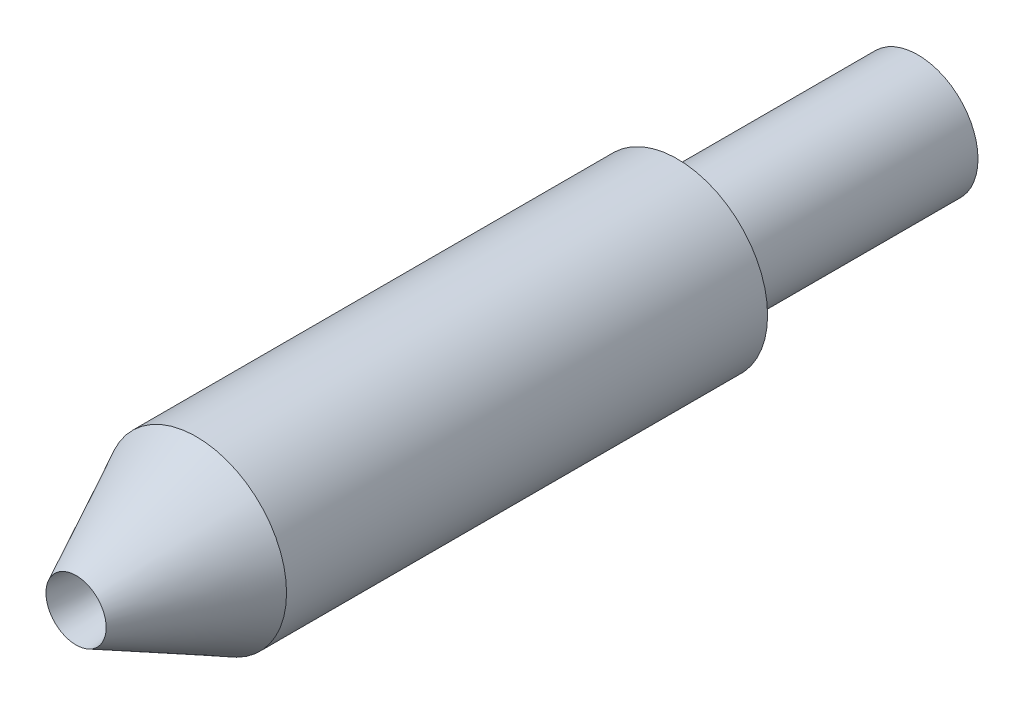
ISO-10303-21;
HEADER;
FILE_DESCRIPTION(('STEP AP214'),'2;1');
FILE_NAME('part.step','',(''),(''),'','','');
FILE_SCHEMA(('AUTOMOTIVE_DESIGN { 1 0 10303 214 1 1 1 1 }'));
ENDSEC;
DATA;
#1=APPLICATION_CONTEXT('core data for automotive mechanical design processes');
#2=APPLICATION_PROTOCOL_DEFINITION('international standard','automotive_design',2000,#1);
#3=PRODUCT_CONTEXT('',#1,'mechanical');
#4=PRODUCT('Part','Part','',(#3));
#5=PRODUCT_RELATED_PRODUCT_CATEGORY('part','',(#4));
#6=PRODUCT_DEFINITION_FORMATION('','',#4);
#7=PRODUCT_DEFINITION_CONTEXT('part definition',#1,'design');
#8=PRODUCT_DEFINITION('design','',#6,#7);
#9=PRODUCT_DEFINITION_SHAPE('','',#8);
#10=(LENGTH_UNIT() NAMED_UNIT(*) SI_UNIT(.MILLI.,.METRE.));
#11=(NAMED_UNIT(*) PLANE_ANGLE_UNIT() SI_UNIT($,.RADIAN.));
#12=(NAMED_UNIT(*) SI_UNIT($,.STERADIAN.) SOLID_ANGLE_UNIT());
#13=UNCERTAINTY_MEASURE_WITH_UNIT(LENGTH_MEASURE(1.E-05),#10,'distance_accuracy_value','');
#14=(GEOMETRIC_REPRESENTATION_CONTEXT(3) GLOBAL_UNCERTAINTY_ASSIGNED_CONTEXT((#13)) GLOBAL_UNIT_ASSIGNED_CONTEXT((#10,
#11,#12)) REPRESENTATION_CONTEXT('',''));
#15=CARTESIAN_POINT('',(0.,0.,0.));
#16=DIRECTION('',(0.,0.,1.));
#17=DIRECTION('',(1.,0.,0.));
#18=AXIS2_PLACEMENT_3D('',#15,#16,#17);
#19=CARTESIAN_POINT('',(0.,0.,-11.1125));
#20=DIRECTION('',(0.,0.,1.));
#21=DIRECTION('',(1.,0.,0.));
#22=AXIS2_PLACEMENT_3D('',#19,#20,#21);
#23=CYLINDRICAL_SURFACE('',#22,1.19126);
#24=CARTESIAN_POINT('',(0.,0.,-1.58749999999999));
#25=DIRECTION('',(0.,0.,1.));
#26=DIRECTION('',(1.,0.,0.));
#27=AXIS2_PLACEMENT_3D('',#24,#25,#26);
#28=CIRCLE('',#27,1.19126);
#29=CARTESIAN_POINT('',(1.19126,0.,-1.58749999999999));
#30=VERTEX_POINT('',#29);
#31=EDGE_CURVE('E12',#30,#30,#28,.T.);
#32=ORIENTED_EDGE('',*,*,#31,.F.);
#33=EDGE_LOOP('',(#32));
#34=FACE_BOUND('',#33,.T.);
#35=CARTESIAN_POINT('',(0.,0.,-7.93749999999999));
#36=DIRECTION('',(0.,0.,1.));
#37=DIRECTION('',(1.,0.,0.));
#38=AXIS2_PLACEMENT_3D('',#35,#36,#37);
#39=CIRCLE('',#38,1.19126);
#40=CARTESIAN_POINT('',(1.19126,0.,-7.93749999999999));
#41=VERTEX_POINT('',#40);
#42=EDGE_CURVE('E64',#41,#41,#39,.T.);
#43=ORIENTED_EDGE('',*,*,#42,.T.);
#44=EDGE_LOOP('',(#43));
#45=FACE_BOUND('',#44,.T.);
#46=ADVANCED_FACE('F48',(#34,#45),#23,.T.);
#47=CARTESIAN_POINT('',(0.,0.,0.));
#48=DIRECTION('',(0.,0.,-1.));
#49=DIRECTION('',(-1.,0.,0.));
#50=AXIS2_PLACEMENT_3D('',#47,#48,#49);
#51=CONICAL_SURFACE('',#50,0.39751,0.463647609000806);
#52=ORIENTED_EDGE('',*,*,#31,.T.);
#53=EDGE_LOOP('',(#52));
#54=FACE_BOUND('',#53,.T.);
#55=CARTESIAN_POINT('',(0.,0.,0.));
#56=DIRECTION('',(0.,0.,1.));
#57=DIRECTION('',(1.,0.,0.));
#58=AXIS2_PLACEMENT_3D('',#55,#56,#57);
#59=CIRCLE('',#58,0.39751);
#60=CARTESIAN_POINT('',(0.39751,0.,0.));
#61=VERTEX_POINT('',#60);
#62=EDGE_CURVE('E67',#61,#61,#59,.T.);
#63=ORIENTED_EDGE('',*,*,#62,.F.);
#64=EDGE_LOOP('',(#63));
#65=FACE_BOUND('',#64,.T.);
#66=ADVANCED_FACE('F96',(#54,#65),#51,.T.);
#67=CARTESIAN_POINT('',(0.,0.,0.));
#68=DIRECTION('',(0.,0.,1.));
#69=DIRECTION('',(1.,0.,0.));
#70=AXIS2_PLACEMENT_3D('',#67,#68,#69);
#71=CYLINDRICAL_SURFACE('',#70,0.793749999999999);
#72=CARTESIAN_POINT('',(0.,0.,-11.1125));
#73=DIRECTION('',(0.,0.,1.));
#74=DIRECTION('',(1.,0.,0.));
#75=AXIS2_PLACEMENT_3D('',#72,#73,#74);
#76=CIRCLE('',#75,0.79375);
#77=CARTESIAN_POINT('',(0.79375,0.,-11.1125));
#78=VERTEX_POINT('',#77);
#79=EDGE_CURVE('E55',#78,#78,#76,.T.);
#80=ORIENTED_EDGE('',*,*,#79,.T.);
#81=EDGE_LOOP('',(#80));
#82=FACE_BOUND('',#81,.T.);
#83=CARTESIAN_POINT('',(0.,0.,-7.93749999999999));
#84=DIRECTION('',(0.,0.,1.));
#85=DIRECTION('',(1.,0.,0.));
#86=AXIS2_PLACEMENT_3D('',#83,#84,#85);
#87=CIRCLE('',#86,0.793749999999999);
#88=CARTESIAN_POINT('',(0.793749999999999,0.,-7.93749999999999));
#89=VERTEX_POINT('',#88);
#90=EDGE_CURVE('E59',#89,#89,#87,.T.);
#91=ORIENTED_EDGE('',*,*,#90,.F.);
#92=EDGE_LOOP('',(#91));
#93=FACE_BOUND('',#92,.T.);
#94=ADVANCED_FACE('F101',(#82,#93),#71,.T.);
#95=CARTESIAN_POINT('',(0.,1.19126,-7.93749999999999));
#96=DIRECTION('',(0.,0.,-1.));
#97=DIRECTION('',(-1.,0.,0.));
#98=AXIS2_PLACEMENT_3D('',#95,#96,#97);
#99=PLANE('',#98);
#100=ORIENTED_EDGE('',*,*,#90,.T.);
#101=EDGE_LOOP('',(#100));
#102=FACE_BOUND('',#101,.T.);
#103=ORIENTED_EDGE('',*,*,#42,.F.);
#104=EDGE_LOOP('',(#103));
#105=FACE_BOUND('',#104,.T.);
#106=ADVANCED_FACE('F92',(#102,#105),#99,.T.);
#107=CARTESIAN_POINT('',(0.,0.,-11.1125));
#108=DIRECTION('',(0.,0.,1.));
#109=DIRECTION('',(1.,0.,0.));
#110=AXIS2_PLACEMENT_3D('',#107,#108,#109);
#111=PLANE('',#110);
#112=CARTESIAN_POINT('',(0.,0.,-11.1125));
#113=DIRECTION('',(0.,0.,1.));
#114=DIRECTION('',(1.,0.,0.));
#115=AXIS2_PLACEMENT_3D('',#112,#113,#114);
#116=CIRCLE('',#115,0.39751);
#117=CARTESIAN_POINT('',(0.39751,0.,-11.1125));
#118=VERTEX_POINT('',#117);
#119=EDGE_CURVE('E51',#118,#118,#116,.T.);
#120=ORIENTED_EDGE('',*,*,#119,.T.);
#121=EDGE_LOOP('',(#120));
#122=FACE_BOUND('',#121,.T.);
#123=ORIENTED_EDGE('',*,*,#79,.F.);
#124=EDGE_LOOP('',(#123));
#125=FACE_BOUND('',#124,.T.);
#126=ADVANCED_FACE('F83',(#122,#125),#111,.F.);
#127=CARTESIAN_POINT('',(0.,0.,-1.58749999999999));
#128=DIRECTION('',(0.,0.,1.));
#129=DIRECTION('',(1.,0.,0.));
#130=AXIS2_PLACEMENT_3D('',#127,#128,#129);
#131=CONICAL_SURFACE('',#130,0.19812,0.124945720086004);
#132=ORIENTED_EDGE('',*,*,#62,.T.);
#133=EDGE_LOOP('',(#132));
#134=FACE_BOUND('',#133,.T.);
#135=CARTESIAN_POINT('',(0.,0.,-1.58749999999999));
#136=DIRECTION('',(0.,0.,1.));
#137=DIRECTION('',(0.,-1.,0.));
#138=AXIS2_PLACEMENT_3D('',#135,#136,#137);
#139=CIRCLE('',#138,0.19812);
#140=CARTESIAN_POINT('',(0.,-0.19812,-1.58749999999999));
#141=VERTEX_POINT('',#140);
#142=EDGE_CURVE('E73',#141,#141,#139,.T.);
#143=ORIENTED_EDGE('',*,*,#142,.F.);
#144=EDGE_LOOP('',(#143));
#145=FACE_BOUND('',#144,.T.);
#146=ADVANCED_FACE('F80',(#134,#145),#131,.F.);
#147=CARTESIAN_POINT('',(0.,0.,-13.49502));
#148=DIRECTION('',(0.,0.,1.));
#149=DIRECTION('',(1.,0.,0.));
#150=AXIS2_PLACEMENT_3D('',#147,#148,#149);
#151=CYLINDRICAL_SURFACE('',#150,0.39751);
#152=CARTESIAN_POINT('',(0.,0.,-2.38252));
#153=DIRECTION('',(0.,0.,1.));
#154=DIRECTION('',(0.,-1.,0.));
#155=AXIS2_PLACEMENT_3D('',#152,#153,#154);
#156=CIRCLE('',#155,0.39751);
#157=CARTESIAN_POINT('',(0.,-0.39751,-2.38252));
#158=VERTEX_POINT('',#157);
#159=EDGE_CURVE('E70',#158,#158,#156,.T.);
#160=ORIENTED_EDGE('',*,*,#159,.T.);
#161=EDGE_LOOP('',(#160));
#162=FACE_BOUND('',#161,.T.);
#163=ORIENTED_EDGE('',*,*,#119,.F.);
#164=EDGE_LOOP('',(#163));
#165=FACE_BOUND('',#164,.T.);
#166=ADVANCED_FACE('F82',(#162,#165),#151,.F.);
#167=CARTESIAN_POINT('',(0.,0.,-2.38252));
#168=DIRECTION('',(0.,0.,-1.));
#169=DIRECTION('',(0.,1.,0.));
#170=AXIS2_PLACEMENT_3D('',#167,#168,#169);
#171=CONICAL_SURFACE('',#170,0.39751,0.24573026012927);
#172=ORIENTED_EDGE('',*,*,#142,.T.);
#173=EDGE_LOOP('',(#172));
#174=FACE_BOUND('',#173,.T.);
#175=ORIENTED_EDGE('',*,*,#159,.F.);
#176=EDGE_LOOP('',(#175));
#177=FACE_BOUND('',#176,.T.);
#178=ADVANCED_FACE('F77',(#174,#177),#171,.F.);
#179=CLOSED_SHELL('',(#46,#66,#94,#106,#126,#146,#166,#178));
#180=MANIFOLD_SOLID_BREP('B2',#179);
#181=ADVANCED_BREP_SHAPE_REPRESENTATION('',(#18,#180),#14);
#182=SHAPE_DEFINITION_REPRESENTATION(#9,#181);
ENDSEC;
END-ISO-10303-21;
